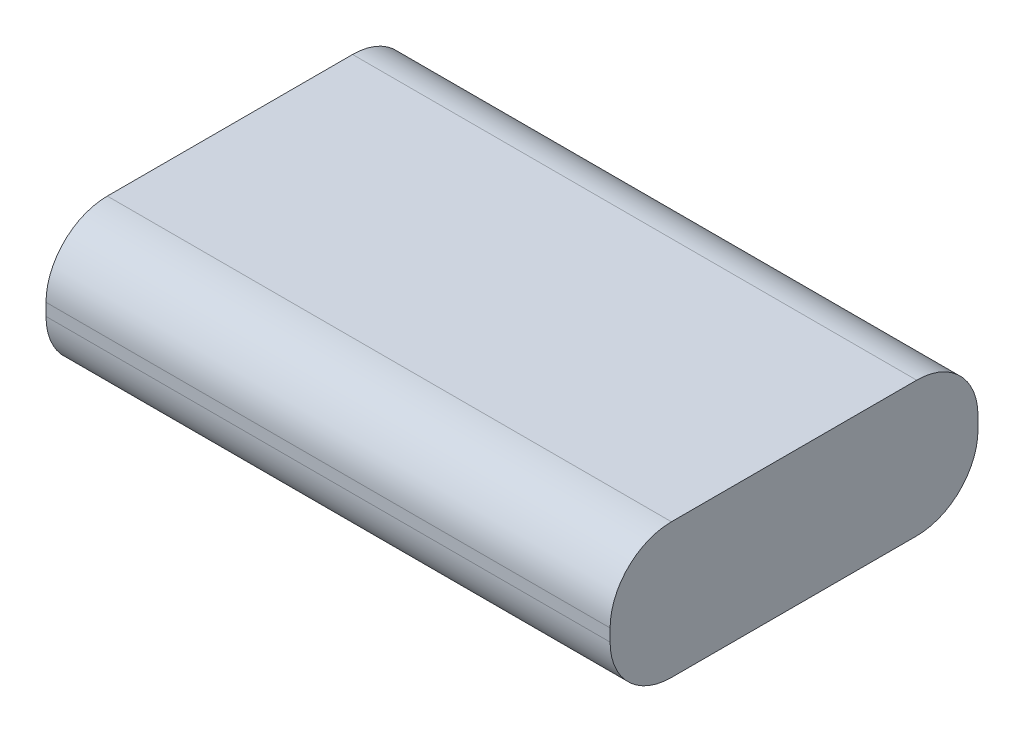
ISO-10303-21;
HEADER;
FILE_DESCRIPTION(('STEP AP214'),'2;1');
FILE_NAME('part.step','',(''),(''),'','','');
FILE_SCHEMA(('AUTOMOTIVE_DESIGN { 1 0 10303 214 1 1 1 1 }'));
ENDSEC;
DATA;
#1=APPLICATION_CONTEXT('core data for automotive mechanical design processes');
#2=APPLICATION_PROTOCOL_DEFINITION('international standard','automotive_design',2000,#1);
#3=PRODUCT_CONTEXT('',#1,'mechanical');
#4=PRODUCT('Part','Part','',(#3));
#5=PRODUCT_RELATED_PRODUCT_CATEGORY('part','',(#4));
#6=PRODUCT_DEFINITION_FORMATION('','',#4);
#7=PRODUCT_DEFINITION_CONTEXT('part definition',#1,'design');
#8=PRODUCT_DEFINITION('design','',#6,#7);
#9=PRODUCT_DEFINITION_SHAPE('','',#8);
#10=(LENGTH_UNIT() NAMED_UNIT(*) SI_UNIT(.MILLI.,.METRE.));
#11=(NAMED_UNIT(*) PLANE_ANGLE_UNIT() SI_UNIT($,.RADIAN.));
#12=(NAMED_UNIT(*) SI_UNIT($,.STERADIAN.) SOLID_ANGLE_UNIT());
#13=UNCERTAINTY_MEASURE_WITH_UNIT(LENGTH_MEASURE(1.E-05),#10,'distance_accuracy_value','');
#14=(GEOMETRIC_REPRESENTATION_CONTEXT(3) GLOBAL_UNCERTAINTY_ASSIGNED_CONTEXT((#13)) GLOBAL_UNIT_ASSIGNED_CONTEXT((#10,
#11,#12)) REPRESENTATION_CONTEXT('',''));
#15=CARTESIAN_POINT('',(0.,0.,0.));
#16=DIRECTION('',(0.,0.,1.));
#17=DIRECTION('',(1.,0.,0.));
#18=AXIS2_PLACEMENT_3D('',#15,#16,#17);
#19=CARTESIAN_POINT('',(46.,22.,30.));
#20=DIRECTION('',(-1.,0.,0.));
#21=DIRECTION('',(0.,0.,1.));
#22=AXIS2_PLACEMENT_3D('',#19,#20,#21);
#23=PLANE('',#22);
#24=DIRECTION('',(0.,0.,-1.));
#25=VECTOR('',#24,1.);
#26=CARTESIAN_POINT('',(46.,0.,30.));
#27=LINE('',#26,#25);
#28=CARTESIAN_POINT('',(46.,0.,20.));
#29=VERTEX_POINT('',#28);
#30=CARTESIAN_POINT('',(46.,0.,-20.));
#31=VERTEX_POINT('',#30);
#32=EDGE_CURVE('E195',#29,#31,#27,.T.);
#33=ORIENTED_EDGE('',*,*,#32,.T.);
#34=CARTESIAN_POINT('',(46.,10.,-20.));
#35=DIRECTION('',(-1.,0.,0.));
#36=DIRECTION('',(0.,0.,1.));
#37=AXIS2_PLACEMENT_3D('',#34,#35,#36);
#38=CIRCLE('',#37,10.);
#39=CARTESIAN_POINT('',(46.,10.,-30.));
#40=VERTEX_POINT('',#39);
#41=EDGE_CURVE('E161',#31,#40,#38,.F.);
#42=ORIENTED_EDGE('',*,*,#41,.T.);
#43=DIRECTION('',(0.,-1.,0.));
#44=VECTOR('',#43,1.);
#45=CARTESIAN_POINT('',(46.,22.,-30.));
#46=LINE('',#45,#44);
#47=CARTESIAN_POINT('',(46.,12.,-30.));
#48=VERTEX_POINT('',#47);
#49=EDGE_CURVE('E129',#48,#40,#46,.T.);
#50=ORIENTED_EDGE('',*,*,#49,.F.);
#51=CARTESIAN_POINT('',(46.,12.,-20.));
#52=DIRECTION('',(-1.,0.,0.));
#53=DIRECTION('',(0.,0.,1.));
#54=AXIS2_PLACEMENT_3D('',#51,#52,#53);
#55=CIRCLE('',#54,10.);
#56=CARTESIAN_POINT('',(46.,22.,-20.));
#57=VERTEX_POINT('',#56);
#58=EDGE_CURVE('E134',#48,#57,#55,.F.);
#59=ORIENTED_EDGE('',*,*,#58,.T.);
#60=DIRECTION('',(0.,0.,-1.));
#61=VECTOR('',#60,1.);
#62=CARTESIAN_POINT('',(46.,22.,30.));
#63=LINE('',#62,#61);
#64=CARTESIAN_POINT('',(46.,22.,20.));
#65=VERTEX_POINT('',#64);
#66=EDGE_CURVE('E187',#65,#57,#63,.T.);
#67=ORIENTED_EDGE('',*,*,#66,.F.);
#68=CARTESIAN_POINT('',(46.,12.,20.));
#69=DIRECTION('',(-1.,0.,0.));
#70=DIRECTION('',(0.,0.,1.));
#71=AXIS2_PLACEMENT_3D('',#68,#69,#70);
#72=CIRCLE('',#71,10.);
#73=CARTESIAN_POINT('',(46.,12.,30.));
#74=VERTEX_POINT('',#73);
#75=EDGE_CURVE('E62',#65,#74,#72,.F.);
#76=ORIENTED_EDGE('',*,*,#75,.T.);
#77=DIRECTION('',(0.,-1.,0.));
#78=VECTOR('',#77,1.);
#79=CARTESIAN_POINT('',(46.,22.,30.));
#80=LINE('',#79,#78);
#81=CARTESIAN_POINT('',(46.,10.,30.));
#82=VERTEX_POINT('',#81);
#83=EDGE_CURVE('E176',#74,#82,#80,.T.);
#84=ORIENTED_EDGE('',*,*,#83,.T.);
#85=CARTESIAN_POINT('',(46.,10.,20.));
#86=DIRECTION('',(-1.,0.,0.));
#87=DIRECTION('',(0.,0.,1.));
#88=AXIS2_PLACEMENT_3D('',#85,#86,#87);
#89=CIRCLE('',#88,10.);
#90=EDGE_CURVE('E55',#82,#29,#89,.F.);
#91=ORIENTED_EDGE('',*,*,#90,.T.);
#92=EDGE_LOOP('',(#33,#42,#50,#59,#67,#76,#84,#91));
#93=FACE_BOUND('',#92,.T.);
#94=ADVANCED_FACE('F39',(#93),#23,.F.);
#95=CARTESIAN_POINT('',(-46.,22.,-30.));
#96=DIRECTION('',(0.,0.,1.));
#97=DIRECTION('',(1.,0.,0.));
#98=AXIS2_PLACEMENT_3D('',#95,#96,#97);
#99=PLANE('',#98);
#100=ORIENTED_EDGE('',*,*,#49,.T.);
#101=DIRECTION('',(-1.,0.,0.));
#102=VECTOR('',#101,1.);
#103=CARTESIAN_POINT('',(-46.,10.,-30.));
#104=LINE('',#103,#102);
#105=CARTESIAN_POINT('',(-46.,10.,-30.));
#106=VERTEX_POINT('',#105);
#107=EDGE_CURVE('E127',#40,#106,#104,.T.);
#108=ORIENTED_EDGE('',*,*,#107,.T.);
#109=DIRECTION('',(0.,-1.,0.));
#110=VECTOR('',#109,1.);
#111=CARTESIAN_POINT('',(-46.,22.,-30.));
#112=LINE('',#111,#110);
#113=CARTESIAN_POINT('',(-46.,12.,-30.));
#114=VERTEX_POINT('',#113);
#115=EDGE_CURVE('E109',#114,#106,#112,.T.);
#116=ORIENTED_EDGE('',*,*,#115,.F.);
#117=DIRECTION('',(-1.,0.,0.));
#118=VECTOR('',#117,1.);
#119=CARTESIAN_POINT('',(-46.,12.,-30.));
#120=LINE('',#119,#118);
#121=EDGE_CURVE('E124',#114,#48,#120,.F.);
#122=ORIENTED_EDGE('',*,*,#121,.T.);
#123=EDGE_LOOP('',(#100,#108,#116,#122));
#124=FACE_BOUND('',#123,.T.);
#125=ADVANCED_FACE('F123',(#124),#99,.F.);
#126=CARTESIAN_POINT('',(-46.,22.,30.));
#127=DIRECTION('',(1.,0.,0.));
#128=DIRECTION('',(0.,0.,-1.));
#129=AXIS2_PLACEMENT_3D('',#126,#127,#128);
#130=PLANE('',#129);
#131=ORIENTED_EDGE('',*,*,#115,.T.);
#132=CARTESIAN_POINT('',(-46.,10.,-20.));
#133=DIRECTION('',(1.,0.,0.));
#134=DIRECTION('',(0.,0.,-1.));
#135=AXIS2_PLACEMENT_3D('',#132,#133,#134);
#136=CIRCLE('',#135,10.);
#137=CARTESIAN_POINT('',(-46.,0.,-20.));
#138=VERTEX_POINT('',#137);
#139=EDGE_CURVE('E117',#106,#138,#136,.F.);
#140=ORIENTED_EDGE('',*,*,#139,.T.);
#141=DIRECTION('',(0.,0.,1.));
#142=VECTOR('',#141,1.);
#143=CARTESIAN_POINT('',(-46.,0.,30.));
#144=LINE('',#143,#142);
#145=CARTESIAN_POINT('',(-46.,0.,20.));
#146=VERTEX_POINT('',#145);
#147=EDGE_CURVE('E190',#138,#146,#144,.T.);
#148=ORIENTED_EDGE('',*,*,#147,.T.);
#149=CARTESIAN_POINT('',(-46.,10.,20.));
#150=DIRECTION('',(1.,0.,0.));
#151=DIRECTION('',(0.,0.,-1.));
#152=AXIS2_PLACEMENT_3D('',#149,#150,#151);
#153=CIRCLE('',#152,10.);
#154=CARTESIAN_POINT('',(-46.,10.,30.));
#155=VERTEX_POINT('',#154);
#156=EDGE_CURVE('E118',#146,#155,#153,.F.);
#157=ORIENTED_EDGE('',*,*,#156,.T.);
#158=DIRECTION('',(0.,-1.,0.));
#159=VECTOR('',#158,1.);
#160=CARTESIAN_POINT('',(-46.,22.,30.));
#161=LINE('',#160,#159);
#162=CARTESIAN_POINT('',(-46.,12.,30.));
#163=VERTEX_POINT('',#162);
#164=EDGE_CURVE('E130',#163,#155,#161,.T.);
#165=ORIENTED_EDGE('',*,*,#164,.F.);
#166=CARTESIAN_POINT('',(-46.,12.,20.));
#167=DIRECTION('',(1.,0.,0.));
#168=DIRECTION('',(0.,0.,-1.));
#169=AXIS2_PLACEMENT_3D('',#166,#167,#168);
#170=CIRCLE('',#169,10.);
#171=CARTESIAN_POINT('',(-46.,22.,20.));
#172=VERTEX_POINT('',#171);
#173=EDGE_CURVE('E139',#163,#172,#170,.F.);
#174=ORIENTED_EDGE('',*,*,#173,.T.);
#175=DIRECTION('',(0.,0.,1.));
#176=VECTOR('',#175,1.);
#177=CARTESIAN_POINT('',(-46.,22.,30.));
#178=LINE('',#177,#176);
#179=CARTESIAN_POINT('',(-46.,22.,-20.));
#180=VERTEX_POINT('',#179);
#181=EDGE_CURVE('E111',#180,#172,#178,.T.);
#182=ORIENTED_EDGE('',*,*,#181,.F.);
#183=CARTESIAN_POINT('',(-46.,12.,-20.));
#184=DIRECTION('',(1.,0.,0.));
#185=DIRECTION('',(0.,0.,-1.));
#186=AXIS2_PLACEMENT_3D('',#183,#184,#185);
#187=CIRCLE('',#186,10.);
#188=EDGE_CURVE('E106',#180,#114,#187,.F.);
#189=ORIENTED_EDGE('',*,*,#188,.T.);
#190=EDGE_LOOP('',(#131,#140,#148,#157,#165,#174,#182,#189));
#191=FACE_BOUND('',#190,.T.);
#192=ADVANCED_FACE('F108',(#191),#130,.F.);
#193=CARTESIAN_POINT('',(-46.,22.,30.));
#194=DIRECTION('',(0.,0.,-1.));
#195=DIRECTION('',(-1.,0.,0.));
#196=AXIS2_PLACEMENT_3D('',#193,#194,#195);
#197=PLANE('',#196);
#198=ORIENTED_EDGE('',*,*,#164,.T.);
#199=DIRECTION('',(1.,0.,0.));
#200=VECTOR('',#199,1.);
#201=CARTESIAN_POINT('',(46.,10.,30.));
#202=LINE('',#201,#200);
#203=EDGE_CURVE('E11',#155,#82,#202,.T.);
#204=ORIENTED_EDGE('',*,*,#203,.T.);
#205=ORIENTED_EDGE('',*,*,#83,.F.);
#206=DIRECTION('',(1.,0.,0.));
#207=VECTOR('',#206,1.);
#208=CARTESIAN_POINT('',(-46.,12.,30.));
#209=LINE('',#208,#207);
#210=EDGE_CURVE('E48',#74,#163,#209,.F.);
#211=ORIENTED_EDGE('',*,*,#210,.T.);
#212=EDGE_LOOP('',(#198,#204,#205,#211));
#213=FACE_BOUND('',#212,.T.);
#214=ADVANCED_FACE('F175',(#213),#197,.F.);
#215=CARTESIAN_POINT('',(0.,22.,0.));
#216=DIRECTION('',(0.,-1.,0.));
#217=DIRECTION('',(0.,0.,-1.));
#218=AXIS2_PLACEMENT_3D('',#215,#216,#217);
#219=PLANE('',#218);
#220=ORIENTED_EDGE('',*,*,#66,.T.);
#221=DIRECTION('',(-1.,0.,0.));
#222=VECTOR('',#221,1.);
#223=CARTESIAN_POINT('',(0.,22.,-20.));
#224=LINE('',#223,#222);
#225=EDGE_CURVE('E168',#57,#180,#224,.T.);
#226=ORIENTED_EDGE('',*,*,#225,.T.);
#227=ORIENTED_EDGE('',*,*,#181,.T.);
#228=DIRECTION('',(1.,0.,0.));
#229=VECTOR('',#228,1.);
#230=CARTESIAN_POINT('',(0.,22.,20.));
#231=LINE('',#230,#229);
#232=EDGE_CURVE('E164',#172,#65,#231,.T.);
#233=ORIENTED_EDGE('',*,*,#232,.T.);
#234=EDGE_LOOP('',(#220,#226,#227,#233));
#235=FACE_BOUND('',#234,.T.);
#236=ADVANCED_FACE('F186',(#235),#219,.F.);
#237=CARTESIAN_POINT('',(0.,0.,0.));
#238=DIRECTION('',(0.,-1.,0.));
#239=DIRECTION('',(0.,0.,-1.));
#240=AXIS2_PLACEMENT_3D('',#237,#238,#239);
#241=PLANE('',#240);
#242=ORIENTED_EDGE('',*,*,#147,.F.);
#243=DIRECTION('',(-1.,0.,0.));
#244=VECTOR('',#243,1.);
#245=CARTESIAN_POINT('',(46.,0.,-20.));
#246=LINE('',#245,#244);
#247=EDGE_CURVE('E152',#138,#31,#246,.F.);
#248=ORIENTED_EDGE('',*,*,#247,.T.);
#249=ORIENTED_EDGE('',*,*,#32,.F.);
#250=DIRECTION('',(1.,0.,0.));
#251=VECTOR('',#250,1.);
#252=CARTESIAN_POINT('',(-46.,0.,20.));
#253=LINE('',#252,#251);
#254=EDGE_CURVE('E149',#29,#146,#253,.F.);
#255=ORIENTED_EDGE('',*,*,#254,.T.);
#256=EDGE_LOOP('',(#242,#248,#249,#255));
#257=FACE_BOUND('',#256,.T.);
#258=ADVANCED_FACE('F205',(#257),#241,.T.);
#259=CARTESIAN_POINT('',(-46.,10.,-20.));
#260=DIRECTION('',(1.,0.,0.));
#261=DIRECTION('',(0.,0.,-1.));
#262=AXIS2_PLACEMENT_3D('',#259,#260,#261);
#263=CYLINDRICAL_SURFACE('',#262,10.);
#264=ORIENTED_EDGE('',*,*,#41,.F.);
#265=ORIENTED_EDGE('',*,*,#247,.F.);
#266=ORIENTED_EDGE('',*,*,#139,.F.);
#267=ORIENTED_EDGE('',*,*,#107,.F.);
#268=EDGE_LOOP('',(#264,#265,#266,#267));
#269=FACE_BOUND('',#268,.T.);
#270=ADVANCED_FACE('F213',(#269),#263,.T.);
#271=CARTESIAN_POINT('',(0.,12.,-20.));
#272=DIRECTION('',(-1.,0.,0.));
#273=DIRECTION('',(0.,0.,1.));
#274=AXIS2_PLACEMENT_3D('',#271,#272,#273);
#275=CYLINDRICAL_SURFACE('',#274,10.);
#276=ORIENTED_EDGE('',*,*,#58,.F.);
#277=ORIENTED_EDGE('',*,*,#121,.F.);
#278=ORIENTED_EDGE('',*,*,#188,.F.);
#279=ORIENTED_EDGE('',*,*,#225,.F.);
#280=EDGE_LOOP('',(#276,#277,#278,#279));
#281=FACE_BOUND('',#280,.T.);
#282=ADVANCED_FACE('F133',(#281),#275,.T.);
#283=CARTESIAN_POINT('',(-46.,10.,20.));
#284=DIRECTION('',(-1.,0.,0.));
#285=DIRECTION('',(0.,0.,1.));
#286=AXIS2_PLACEMENT_3D('',#283,#284,#285);
#287=CYLINDRICAL_SURFACE('',#286,10.);
#288=ORIENTED_EDGE('',*,*,#156,.F.);
#289=ORIENTED_EDGE('',*,*,#254,.F.);
#290=ORIENTED_EDGE('',*,*,#90,.F.);
#291=ORIENTED_EDGE('',*,*,#203,.F.);
#292=EDGE_LOOP('',(#288,#289,#290,#291));
#293=FACE_BOUND('',#292,.T.);
#294=ADVANCED_FACE('F207',(#293),#287,.T.);
#295=CARTESIAN_POINT('',(0.,12.,20.));
#296=DIRECTION('',(1.,0.,0.));
#297=DIRECTION('',(0.,0.,-1.));
#298=AXIS2_PLACEMENT_3D('',#295,#296,#297);
#299=CYLINDRICAL_SURFACE('',#298,10.);
#300=ORIENTED_EDGE('',*,*,#173,.F.);
#301=ORIENTED_EDGE('',*,*,#210,.F.);
#302=ORIENTED_EDGE('',*,*,#75,.F.);
#303=ORIENTED_EDGE('',*,*,#232,.F.);
#304=EDGE_LOOP('',(#300,#301,#302,#303));
#305=FACE_BOUND('',#304,.T.);
#306=ADVANCED_FACE('F41',(#305),#299,.T.);
#307=CLOSED_SHELL('',(#94,#125,#192,#214,#236,#258,#270,#282,#294,#306));
#308=MANIFOLD_SOLID_BREP('B2',#307);
#309=ADVANCED_BREP_SHAPE_REPRESENTATION('',(#18,#308),#14);
#310=SHAPE_DEFINITION_REPRESENTATION(#9,#309);
ENDSEC;
END-ISO-10303-21;
